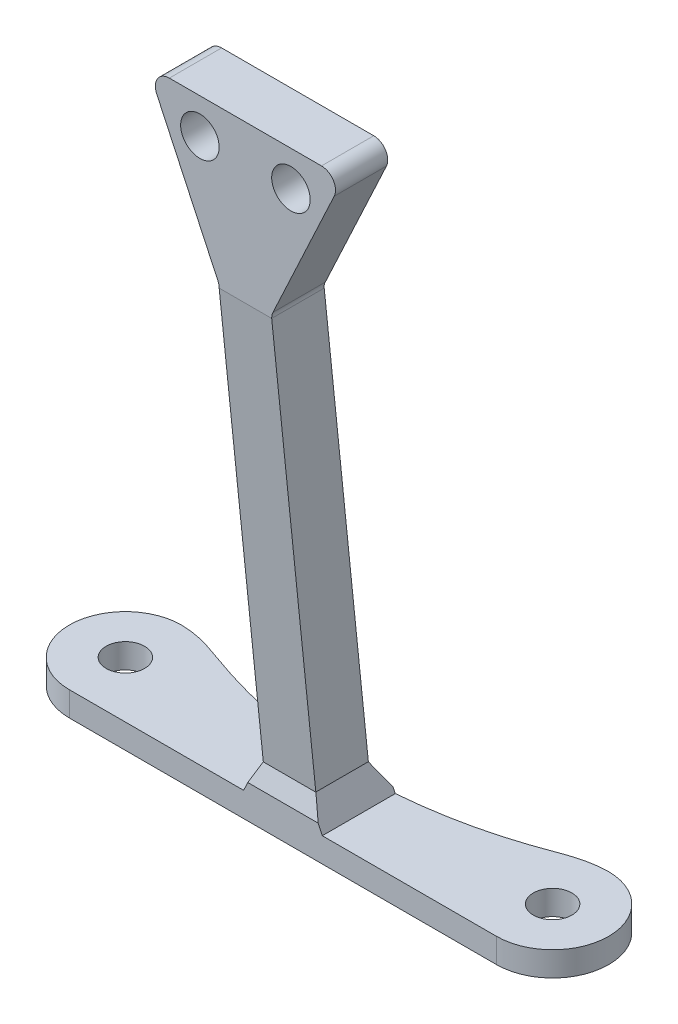
ISO-10303-21;
HEADER;
FILE_DESCRIPTION(('STEP AP214'),'2;1');
FILE_NAME('part.step','',(''),(''),'','','');
FILE_SCHEMA(('AUTOMOTIVE_DESIGN { 1 0 10303 214 1 1 1 1 }'));
ENDSEC;
DATA;
#1=APPLICATION_CONTEXT('core data for automotive mechanical design processes');
#2=APPLICATION_PROTOCOL_DEFINITION('international standard','automotive_design',2000,#1);
#3=PRODUCT_CONTEXT('',#1,'mechanical');
#4=PRODUCT('Part','Part','',(#3));
#5=PRODUCT_RELATED_PRODUCT_CATEGORY('part','',(#4));
#6=PRODUCT_DEFINITION_FORMATION('','',#4);
#7=PRODUCT_DEFINITION_CONTEXT('part definition',#1,'design');
#8=PRODUCT_DEFINITION('design','',#6,#7);
#9=PRODUCT_DEFINITION_SHAPE('','',#8);
#10=(LENGTH_UNIT() NAMED_UNIT(*) SI_UNIT(.MILLI.,.METRE.));
#11=(NAMED_UNIT(*) PLANE_ANGLE_UNIT() SI_UNIT($,.RADIAN.));
#12=(NAMED_UNIT(*) SI_UNIT($,.STERADIAN.) SOLID_ANGLE_UNIT());
#13=UNCERTAINTY_MEASURE_WITH_UNIT(LENGTH_MEASURE(1.E-05),#10,'distance_accuracy_value','');
#14=(GEOMETRIC_REPRESENTATION_CONTEXT(3) GLOBAL_UNCERTAINTY_ASSIGNED_CONTEXT((#13)) GLOBAL_UNIT_ASSIGNED_CONTEXT((#10,
#11,#12)) REPRESENTATION_CONTEXT('',''));
#15=CARTESIAN_POINT('',(0.,0.,0.));
#16=DIRECTION('',(0.,0.,1.));
#17=DIRECTION('',(1.,0.,0.));
#18=AXIS2_PLACEMENT_3D('',#15,#16,#17);
#19=CARTESIAN_POINT('',(0.,45.81,0.));
#20=DIRECTION('',(0.,-1.,0.));
#21=DIRECTION('',(0.,0.,-1.));
#22=AXIS2_PLACEMENT_3D('',#19,#20,#21);
#23=PLANE('',#22);
#24=DIRECTION('',(-1.,0.,0.));
#25=VECTOR('',#24,1.);
#26=CARTESIAN_POINT('',(9.82019635714979,45.81,6.6805667408057));
#27=LINE('',#26,#25);
#28=CARTESIAN_POINT('',(20.6798036428502,45.81,6.6805667408057));
#29=VERTEX_POINT('',#28);
#30=CARTESIAN_POINT('',(9.82019635714979,45.81,6.6805667408057));
#31=VERTEX_POINT('',#30);
#32=EDGE_CURVE('E546',#29,#31,#27,.T.);
#33=ORIENTED_EDGE('',*,*,#32,.F.);
#34=DIRECTION('',(0.,0.,-1.));
#35=VECTOR('',#34,1.);
#36=CARTESIAN_POINT('',(20.6798036428502,45.81,0.));
#37=LINE('',#36,#35);
#38=CARTESIAN_POINT('',(20.6798036428502,45.81,2.95));
#39=VERTEX_POINT('',#38);
#40=EDGE_CURVE('E232',#29,#39,#37,.T.);
#41=ORIENTED_EDGE('',*,*,#40,.T.);
#42=DIRECTION('',(-1.,0.,0.));
#43=VECTOR('',#42,1.);
#44=CARTESIAN_POINT('',(22.25,45.81,2.95));
#45=LINE('',#44,#43);
#46=CARTESIAN_POINT('',(9.82019635714979,45.81,2.95));
#47=VERTEX_POINT('',#46);
#48=EDGE_CURVE('E387',#39,#47,#45,.T.);
#49=ORIENTED_EDGE('',*,*,#48,.T.);
#50=DIRECTION('',(0.,0.,-1.));
#51=VECTOR('',#50,1.);
#52=CARTESIAN_POINT('',(9.82019635714979,45.81,0.));
#53=LINE('',#52,#51);
#54=EDGE_CURVE('E226',#47,#31,#53,.F.);
#55=ORIENTED_EDGE('',*,*,#54,.T.);
#56=EDGE_LOOP('',(#33,#41,#49,#55));
#57=FACE_BOUND('',#56,.T.);
#58=ADVANCED_FACE('F48',(#57),#23,.F.);
#59=CARTESIAN_POINT('',(0.,-0.318008475422429,3.11365631713605));
#60=DIRECTION('',(0.,0.101604896525646,-0.99482483131555));
#61=DIRECTION('',(0.,0.99482483131555,0.101604896525646));
#62=AXIS2_PLACEMENT_3D('',#59,#60,#61);
#63=PLANE('',#62);
#64=DIRECTION('',(1.,0.,0.));
#65=VECTOR('',#64,1.);
#66=CARTESIAN_POINT('',(13.375,34.6060078061076,6.6805667408057));
#67=LINE('',#66,#65);
#68=CARTESIAN_POINT('',(13.375,34.6060078061076,6.6805667408057));
#69=VERTEX_POINT('',#68);
#70=CARTESIAN_POINT('',(17.125,34.6060078061076,6.6805667408057));
#71=VERTEX_POINT('',#70);
#72=EDGE_CURVE('E193',#69,#71,#67,.T.);
#73=ORIENTED_EDGE('',*,*,#72,.F.);
#74=DIRECTION('',(0.,-0.99482483131555,-0.101604896525646));
#75=VECTOR('',#74,1.);
#76=CARTESIAN_POINT('',(13.375,45.81,7.82486916641886));
#77=LINE('',#76,#75);
#78=CARTESIAN_POINT('',(13.375,3.74999999999998,3.52913607517964));
#79=VERTEX_POINT('',#78);
#80=EDGE_CURVE('E207',#69,#79,#77,.T.);
#81=ORIENTED_EDGE('',*,*,#80,.T.);
#82=DIRECTION('',(-0.420819283952313,-0.902449866719604,-0.092170322293196));
#83=VECTOR('',#82,1.);
#84=CARTESIAN_POINT('',(9.44542044298288,-4.67701055471604,2.66845637712649));
#85=LINE('',#84,#83);
#86=CARTESIAN_POINT('',(13.3701735584204,3.73964966263111,3.52807895947016));
#87=VERTEX_POINT('',#86);
#88=EDGE_CURVE('E414',#79,#87,#85,.T.);
#89=ORIENTED_EDGE('',*,*,#88,.T.);
#90=DIRECTION('',(1.,0.,0.));
#91=VECTOR('',#90,1.);
#92=CARTESIAN_POINT('',(0.,3.73964966263111,3.52807895947016));
#93=LINE('',#92,#91);
#94=CARTESIAN_POINT('',(17.1298264415796,3.73964966263111,3.52807895947016));
#95=VERTEX_POINT('',#94);
#96=EDGE_CURVE('E424',#87,#95,#93,.T.);
#97=ORIENTED_EDGE('',*,*,#96,.T.);
#98=DIRECTION('',(-0.420819283952313,0.902449866719604,0.092170322293196));
#99=VECTOR('',#98,1.);
#100=CARTESIAN_POINT('',(15.6533690297599,6.90592280011597,3.85146137251332));
#101=LINE('',#100,#99);
#102=CARTESIAN_POINT('',(17.125,3.74999999999997,3.52913607517964));
#103=VERTEX_POINT('',#102);
#104=EDGE_CURVE('E523',#95,#103,#101,.T.);
#105=ORIENTED_EDGE('',*,*,#104,.T.);
#106=DIRECTION('',(0.,-0.99482483131555,-0.101604896525646));
#107=VECTOR('',#106,1.);
#108=CARTESIAN_POINT('',(17.125,45.81,7.82486916641887));
#109=LINE('',#108,#107);
#110=EDGE_CURVE('E210',#71,#103,#109,.T.);
#111=ORIENTED_EDGE('',*,*,#110,.F.);
#112=EDGE_LOOP('',(#73,#81,#89,#97,#105,#111));
#113=FACE_BOUND('',#112,.T.);
#114=ADVANCED_FACE('F205',(#113),#63,.F.);
#115=CARTESIAN_POINT('',(8.25,45.81,27.6305217725262));
#116=DIRECTION('',(0.906183139995265,0.422885465331124,0.));
#117=DIRECTION('',(-0.422885465331124,0.906183139995265,0.));
#118=AXIS2_PLACEMENT_3D('',#115,#116,#117);
#119=PLANE('',#118);
#120=DIRECTION('',(0.422885465331124,-0.906183139995265,0.));
#121=VECTOR('',#120,1.);
#122=CARTESIAN_POINT('',(13.2811831399953,35.0288932714387,6.6805667408057));
#123=LINE('',#122,#121);
#124=CARTESIAN_POINT('',(8.91401321715453,44.3871145346689,6.6805667408057));
#125=VERTEX_POINT('',#124);
#126=CARTESIAN_POINT('',(13.2811831399953,35.0288932714387,6.6805667408057));
#127=VERTEX_POINT('',#126);
#128=EDGE_CURVE('E196',#125,#127,#123,.T.);
#129=ORIENTED_EDGE('',*,*,#128,.F.);
#130=DIRECTION('',(0.,0.,-1.));
#131=VECTOR('',#130,1.);
#132=CARTESIAN_POINT('',(8.91401321715453,44.3871145346689,27.6305217725262));
#133=LINE('',#132,#131);
#134=CARTESIAN_POINT('',(8.91401321715453,44.3871145346689,2.95));
#135=VERTEX_POINT('',#134);
#136=EDGE_CURVE('E537',#125,#135,#133,.T.);
#137=ORIENTED_EDGE('',*,*,#136,.T.);
#138=DIRECTION('',(0.422885465331124,-0.906183139995265,0.));
#139=VECTOR('',#138,1.);
#140=CARTESIAN_POINT('',(8.25,45.81,2.95));
#141=LINE('',#140,#139);
#142=CARTESIAN_POINT('',(13.3897355304727,34.79628100613,2.95));
#143=VERTEX_POINT('',#142);
#144=EDGE_CURVE('E394',#135,#143,#141,.T.);
#145=ORIENTED_EDGE('',*,*,#144,.T.);
#146=DIRECTION('',(-0.421085842085101,0.902326804468074,0.0921577535203434));
#147=VECTOR('',#146,1.);
#148=CARTESIAN_POINT('',(24.3511281929209,11.3075824437409,0.551018076923493));
#149=LINE('',#148,#147);
#150=CARTESIAN_POINT('',(13.2811831399953,35.0288932714387,2.97375749418723));
#151=VERTEX_POINT('',#150);
#152=EDGE_CURVE('E402',#143,#151,#149,.T.);
#153=ORIENTED_EDGE('',*,*,#152,.T.);
#154=DIRECTION('',(0.,0.,1.));
#155=VECTOR('',#154,1.);
#156=CARTESIAN_POINT('',(13.2811831399953,35.0288932714387,6.70322497991994));
#157=LINE('',#156,#155);
#158=EDGE_CURVE('E535',#151,#127,#157,.T.);
#159=ORIENTED_EDGE('',*,*,#158,.T.);
#160=EDGE_LOOP('',(#129,#137,#145,#153,#159));
#161=FACE_BOUND('',#160,.T.);
#162=ADVANCED_FACE('F347',(#161),#119,.F.);
#163=CARTESIAN_POINT('',(15.25,30.81,27.6305217725262));
#164=DIRECTION('',(-0.906183139995265,0.422885465331124,0.));
#165=DIRECTION('',(-0.422885465331124,-0.906183139995265,0.));
#166=AXIS2_PLACEMENT_3D('',#163,#164,#165);
#167=PLANE('',#166);
#168=DIRECTION('',(0.422885465331124,0.906183139995265,0.));
#169=VECTOR('',#168,1.);
#170=CARTESIAN_POINT('',(21.5859867828455,44.3871145346689,6.6805667408057));
#171=LINE('',#170,#169);
#172=CARTESIAN_POINT('',(17.2188168600047,35.0288932714387,6.6805667408057));
#173=VERTEX_POINT('',#172);
#174=CARTESIAN_POINT('',(21.5859867828455,44.3871145346689,6.6805667408057));
#175=VERTEX_POINT('',#174);
#176=EDGE_CURVE('E65',#173,#175,#171,.T.);
#177=ORIENTED_EDGE('',*,*,#176,.F.);
#178=DIRECTION('',(0.,0.,-1.));
#179=VECTOR('',#178,1.);
#180=CARTESIAN_POINT('',(17.2188168600047,35.0288932714387,2.95322497991993));
#181=LINE('',#180,#179);
#182=CARTESIAN_POINT('',(17.2188168600047,35.0288932714387,2.97375749418723));
#183=VERTEX_POINT('',#182);
#184=EDGE_CURVE('E229',#173,#183,#181,.T.);
#185=ORIENTED_EDGE('',*,*,#184,.T.);
#186=DIRECTION('',(-0.421085842085101,-0.902326804468074,-0.0921577535203434));
#187=VECTOR('',#186,1.);
#188=CARTESIAN_POINT('',(0.740816571741248,-0.281107346268742,-0.632574843072949));
#189=LINE('',#188,#187);
#190=CARTESIAN_POINT('',(17.1102644695273,34.79628100613,2.95));
#191=VERTEX_POINT('',#190);
#192=EDGE_CURVE('E400',#183,#191,#189,.T.);
#193=ORIENTED_EDGE('',*,*,#192,.T.);
#194=DIRECTION('',(0.422885465331124,0.906183139995265,0.));
#195=VECTOR('',#194,1.);
#196=CARTESIAN_POINT('',(15.25,30.81,2.95));
#197=LINE('',#196,#195);
#198=CARTESIAN_POINT('',(21.5859867828455,44.3871145346689,2.95));
#199=VERTEX_POINT('',#198);
#200=EDGE_CURVE('E383',#191,#199,#197,.T.);
#201=ORIENTED_EDGE('',*,*,#200,.T.);
#202=DIRECTION('',(0.,0.,-1.));
#203=VECTOR('',#202,1.);
#204=CARTESIAN_POINT('',(21.5859867828455,44.3871145346689,27.6305217725262));
#205=LINE('',#204,#203);
#206=EDGE_CURVE('E225',#199,#175,#205,.F.);
#207=ORIENTED_EDGE('',*,*,#206,.T.);
#208=EDGE_LOOP('',(#177,#185,#193,#201,#207));
#209=FACE_BOUND('',#208,.T.);
#210=ADVANCED_FACE('F329',(#209),#167,.F.);
#211=CARTESIAN_POINT('',(9.82019635714979,44.81,27.6305217725262));
#212=DIRECTION('',(0.,0.,-1.));
#213=DIRECTION('',(-1.,0.,0.));
#214=AXIS2_PLACEMENT_3D('',#211,#212,#213);
#215=CYLINDRICAL_SURFACE('',#214,1.);
#216=ORIENTED_EDGE('',*,*,#136,.F.);
#217=CARTESIAN_POINT('',(9.82019635714979,44.81,6.6805667408057));
#218=DIRECTION('',(0.,0.,1.));
#219=DIRECTION('',(1.,0.,0.));
#220=AXIS2_PLACEMENT_3D('',#217,#218,#219);
#221=CIRCLE('',#220,0.999999999999999);
#222=EDGE_CURVE('E553',#31,#125,#221,.T.);
#223=ORIENTED_EDGE('',*,*,#222,.F.);
#224=ORIENTED_EDGE('',*,*,#54,.F.);
#225=CARTESIAN_POINT('',(9.82019635714979,44.81,2.95));
#226=DIRECTION('',(0.,0.,1.));
#227=DIRECTION('',(1.,0.,0.));
#228=AXIS2_PLACEMENT_3D('',#225,#226,#227);
#229=CIRCLE('',#228,1.);
#230=EDGE_CURVE('E541',#135,#47,#229,.F.);
#231=ORIENTED_EDGE('',*,*,#230,.F.);
#232=EDGE_LOOP('',(#216,#223,#224,#231));
#233=FACE_BOUND('',#232,.T.);
#234=ADVANCED_FACE('F326',(#233),#215,.T.);
#235=CARTESIAN_POINT('',(12.375,34.6060078061076,27.6305217725262));
#236=DIRECTION('',(0.,0.,-1.));
#237=DIRECTION('',(-1.,0.,0.));
#238=AXIS2_PLACEMENT_3D('',#235,#236,#237);
#239=CYLINDRICAL_SURFACE('',#238,1.);
#240=CARTESIAN_POINT('',(12.375,34.6060078061076,6.6805667408057));
#241=DIRECTION('',(0.,0.,-1.));
#242=DIRECTION('',(1.,0.,0.));
#243=AXIS2_PLACEMENT_3D('',#240,#241,#242);
#244=CIRCLE('',#243,1.);
#245=EDGE_CURVE('E190',#127,#69,#244,.T.);
#246=ORIENTED_EDGE('',*,*,#245,.F.);
#247=ORIENTED_EDGE('',*,*,#158,.F.);
#248=CARTESIAN_POINT('',(12.375,34.6060078061076,2.93056674080571));
#249=DIRECTION('',(0.,-0.101604896525646,0.99482483131555));
#250=DIRECTION('',(0.,-0.99482483131555,-0.101604896525646));
#251=AXIS2_PLACEMENT_3D('',#248,#249,#250);
#252=ELLIPSE('',#251,1.00520209037968,1.);
#253=CARTESIAN_POINT('',(13.375,34.6060078061076,2.93056674080571));
#254=VERTEX_POINT('',#253);
#255=EDGE_CURVE('E57',#254,#151,#252,.T.);
#256=ORIENTED_EDGE('',*,*,#255,.F.);
#257=DIRECTION('',(0.,0.,1.));
#258=VECTOR('',#257,1.);
#259=CARTESIAN_POINT('',(13.375,34.6060078061076,2.95322497991993));
#260=LINE('',#259,#258);
#261=EDGE_CURVE('E215',#69,#254,#260,.F.);
#262=ORIENTED_EDGE('',*,*,#261,.F.);
#263=EDGE_LOOP('',(#246,#247,#256,#262));
#264=FACE_BOUND('',#263,.T.);
#265=ADVANCED_FACE('F223',(#264),#239,.F.);
#266=CARTESIAN_POINT('',(18.125,34.6060078061076,27.6305217725262));
#267=DIRECTION('',(0.,0.,1.));
#268=DIRECTION('',(1.,0.,0.));
#269=AXIS2_PLACEMENT_3D('',#266,#267,#268);
#270=CYLINDRICAL_SURFACE('',#269,1.);
#271=CARTESIAN_POINT('',(18.125,34.6060078061076,6.6805667408057));
#272=DIRECTION('',(0.,0.,-1.));
#273=DIRECTION('',(1.,0.,0.));
#274=AXIS2_PLACEMENT_3D('',#271,#272,#273);
#275=CIRCLE('',#274,1.);
#276=EDGE_CURVE('E211',#71,#173,#275,.T.);
#277=ORIENTED_EDGE('',*,*,#276,.F.);
#278=DIRECTION('',(0.,0.,-1.));
#279=VECTOR('',#278,1.);
#280=CARTESIAN_POINT('',(17.125,34.6060078061076,6.70322497991995));
#281=LINE('',#280,#279);
#282=CARTESIAN_POINT('',(17.125,34.6060078061076,2.93056674080571));
#283=VERTEX_POINT('',#282);
#284=EDGE_CURVE('E240',#283,#71,#281,.F.);
#285=ORIENTED_EDGE('',*,*,#284,.F.);
#286=CARTESIAN_POINT('',(18.125,34.6060078061076,2.93056674080571));
#287=DIRECTION('',(0.,-0.101604896525646,0.99482483131555));
#288=DIRECTION('',(0.,0.99482483131555,0.101604896525646));
#289=AXIS2_PLACEMENT_3D('',#286,#287,#288);
#290=ELLIPSE('',#289,1.00520209037968,1.);
#291=EDGE_CURVE('E12',#183,#283,#290,.T.);
#292=ORIENTED_EDGE('',*,*,#291,.F.);
#293=ORIENTED_EDGE('',*,*,#184,.F.);
#294=EDGE_LOOP('',(#277,#285,#292,#293));
#295=FACE_BOUND('',#294,.T.);
#296=ADVANCED_FACE('F332',(#295),#270,.F.);
#297=CARTESIAN_POINT('',(20.6798036428502,44.81,0.));
#298=DIRECTION('',(0.,0.,-1.));
#299=DIRECTION('',(-1.,0.,0.));
#300=AXIS2_PLACEMENT_3D('',#297,#298,#299);
#301=CYLINDRICAL_SURFACE('',#300,1.);
#302=ORIENTED_EDGE('',*,*,#40,.F.);
#303=CARTESIAN_POINT('',(20.6798036428502,44.81,6.6805667408057));
#304=DIRECTION('',(0.,0.,1.));
#305=DIRECTION('',(1.,0.,0.));
#306=AXIS2_PLACEMENT_3D('',#303,#304,#305);
#307=CIRCLE('',#306,1.);
#308=EDGE_CURVE('E555',#175,#29,#307,.T.);
#309=ORIENTED_EDGE('',*,*,#308,.F.);
#310=ORIENTED_EDGE('',*,*,#206,.F.);
#311=CARTESIAN_POINT('',(20.6798036428502,44.81,2.95));
#312=DIRECTION('',(0.,0.,1.));
#313=DIRECTION('',(1.,0.,0.));
#314=AXIS2_PLACEMENT_3D('',#311,#312,#313);
#315=CIRCLE('',#314,1.);
#316=EDGE_CURVE('E539',#39,#199,#315,.F.);
#317=ORIENTED_EDGE('',*,*,#316,.F.);
#318=EDGE_LOOP('',(#302,#309,#310,#317));
#319=FACE_BOUND('',#318,.T.);
#320=ADVANCED_FACE('F50',(#319),#301,.T.);
#321=CARTESIAN_POINT('',(18.5,43.31,7.82486916641887));
#322=DIRECTION('',(0.,0.,-1.));
#323=DIRECTION('',(-1.,0.,0.));
#324=AXIS2_PLACEMENT_3D('',#321,#322,#323);
#325=CYLINDRICAL_SURFACE('',#324,1.375);
#326=CARTESIAN_POINT('',(18.5,43.31,2.95));
#327=DIRECTION('',(0.,0.,1.));
#328=DIRECTION('',(1.,0.,0.));
#329=AXIS2_PLACEMENT_3D('',#326,#327,#328);
#330=CIRCLE('',#329,1.375);
#331=CARTESIAN_POINT('',(19.875,43.31,2.95));
#332=VERTEX_POINT('',#331);
#333=EDGE_CURVE('E378',#332,#332,#330,.F.);
#334=ORIENTED_EDGE('',*,*,#333,.T.);
#335=EDGE_LOOP('',(#334));
#336=FACE_BOUND('',#335,.T.);
#337=CARTESIAN_POINT('',(18.5,43.31,6.6805667408057));
#338=DIRECTION('',(0.,0.,1.));
#339=DIRECTION('',(1.,0.,0.));
#340=AXIS2_PLACEMENT_3D('',#337,#338,#339);
#341=CIRCLE('',#340,1.375);
#342=CARTESIAN_POINT('',(19.875,43.31,6.6805667408057));
#343=VERTEX_POINT('',#342);
#344=EDGE_CURVE('E381',#343,#343,#341,.T.);
#345=ORIENTED_EDGE('',*,*,#344,.T.);
#346=EDGE_LOOP('',(#345));
#347=FACE_BOUND('',#346,.T.);
#348=ADVANCED_FACE('F338',(#336,#347),#325,.F.);
#349=CARTESIAN_POINT('',(12.,43.31,7.82486916641887));
#350=DIRECTION('',(0.,0.,-1.));
#351=DIRECTION('',(-1.,0.,0.));
#352=AXIS2_PLACEMENT_3D('',#349,#350,#351);
#353=CYLINDRICAL_SURFACE('',#352,1.375);
#354=CARTESIAN_POINT('',(12.,43.31,2.95));
#355=DIRECTION('',(0.,0.,1.));
#356=DIRECTION('',(1.,0.,0.));
#357=AXIS2_PLACEMENT_3D('',#354,#355,#356);
#358=CIRCLE('',#357,1.375);
#359=CARTESIAN_POINT('',(13.375,43.31,2.95));
#360=VERTEX_POINT('',#359);
#361=EDGE_CURVE('E380',#360,#360,#358,.F.);
#362=ORIENTED_EDGE('',*,*,#361,.T.);
#363=EDGE_LOOP('',(#362));
#364=FACE_BOUND('',#363,.T.);
#365=CARTESIAN_POINT('',(12.,43.31,6.6805667408057));
#366=DIRECTION('',(0.,0.,1.));
#367=DIRECTION('',(1.,0.,0.));
#368=AXIS2_PLACEMENT_3D('',#365,#366,#367);
#369=CIRCLE('',#368,1.375);
#370=CARTESIAN_POINT('',(13.375,43.31,6.6805667408057));
#371=VERTEX_POINT('',#370);
#372=EDGE_CURVE('E52',#371,#371,#369,.T.);
#373=ORIENTED_EDGE('',*,*,#372,.T.);
#374=EDGE_LOOP('',(#373));
#375=FACE_BOUND('',#374,.T.);
#376=ADVANCED_FACE('F355',(#364,#375),#353,.F.);
#377=CARTESIAN_POINT('',(0.,0.0610380522536711,-0.5976303516215));
#378=DIRECTION('',(0.,-0.101604896525646,0.99482483131555));
#379=DIRECTION('',(0.,-0.99482483131555,-0.101604896525646));
#380=AXIS2_PLACEMENT_3D('',#377,#378,#379);
#381=PLANE('',#380);
#382=ORIENTED_EDGE('',*,*,#152,.F.);
#383=DIRECTION('',(-1.,0.,0.));
#384=VECTOR('',#383,1.);
#385=CARTESIAN_POINT('',(0.,34.79628100613,2.95));
#386=LINE('',#385,#384);
#387=EDGE_CURVE('E532',#191,#143,#386,.T.);
#388=ORIENTED_EDGE('',*,*,#387,.F.);
#389=ORIENTED_EDGE('',*,*,#192,.F.);
#390=ORIENTED_EDGE('',*,*,#291,.T.);
#391=DIRECTION('',(0.,-0.99482483131555,-0.101604896525646));
#392=VECTOR('',#391,1.);
#393=CARTESIAN_POINT('',(17.125,45.81,4.07486916641886));
#394=LINE('',#393,#392);
#395=CARTESIAN_POINT('',(17.125,3.74999999999997,-0.220863924820357));
#396=VERTEX_POINT('',#395);
#397=EDGE_CURVE('E241',#283,#396,#394,.T.);
#398=ORIENTED_EDGE('',*,*,#397,.T.);
#399=DIRECTION('',(0.420819283952313,-0.902449866719604,-0.092170322293196));
#400=VECTOR('',#399,1.);
#401=CARTESIAN_POINT('',(15.5079175959009,7.21784440662471,0.133319003681943));
#402=LINE('',#401,#400);
#403=CARTESIAN_POINT('',(17.1298264415796,3.73964966263111,-0.221921040529841));
#404=VERTEX_POINT('',#403);
#405=EDGE_CURVE('E293',#396,#404,#402,.T.);
#406=ORIENTED_EDGE('',*,*,#405,.T.);
#407=DIRECTION('',(-1.,0.,0.));
#408=VECTOR('',#407,1.);
#409=CARTESIAN_POINT('',(0.,3.73964966263111,-0.221921040529841));
#410=LINE('',#409,#408);
#411=CARTESIAN_POINT('',(13.3701735584204,3.73964966263111,-0.221921040529841));
#412=VERTEX_POINT('',#411);
#413=EDGE_CURVE('E411',#404,#412,#410,.T.);
#414=ORIENTED_EDGE('',*,*,#413,.T.);
#415=DIRECTION('',(0.420819283952313,0.902449866719604,0.092170322293196));
#416=VECTOR('',#415,1.);
#417=CARTESIAN_POINT('',(9.59087187684191,-4.3650889482073,-1.04968599170489));
#418=LINE('',#417,#416);
#419=CARTESIAN_POINT('',(13.375,3.74999999999998,-0.220863924820357));
#420=VERTEX_POINT('',#419);
#421=EDGE_CURVE('E410',#412,#420,#418,.T.);
#422=ORIENTED_EDGE('',*,*,#421,.T.);
#423=DIRECTION('',(0.,-0.99482483131555,-0.101604896525646));
#424=VECTOR('',#423,1.);
#425=CARTESIAN_POINT('',(13.375,45.81,4.07486916641886));
#426=LINE('',#425,#424);
#427=EDGE_CURVE('E235',#254,#420,#426,.T.);
#428=ORIENTED_EDGE('',*,*,#427,.F.);
#429=ORIENTED_EDGE('',*,*,#255,.T.);
#430=EDGE_LOOP('',(#382,#388,#389,#390,#398,#406,#414,#422,#428,#429));
#431=FACE_BOUND('',#430,.T.);
#432=ADVANCED_FACE('F352',(#431),#381,.F.);
#433=CARTESIAN_POINT('',(13.375,0.,0.));
#434=DIRECTION('',(1.,0.,0.));
#435=DIRECTION('',(0.,1.,0.));
#436=AXIS2_PLACEMENT_3D('',#433,#434,#435);
#437=PLANE('',#436);
#438=ORIENTED_EDGE('',*,*,#80,.F.);
#439=ORIENTED_EDGE('',*,*,#261,.T.);
#440=ORIENTED_EDGE('',*,*,#427,.T.);
#441=DIRECTION('',(0.,0.,1.));
#442=VECTOR('',#441,1.);
#443=CARTESIAN_POINT('',(13.375,3.74999999999998,0.));
#444=LINE('',#443,#442);
#445=EDGE_CURVE('E218',#420,#79,#444,.T.);
#446=ORIENTED_EDGE('',*,*,#445,.T.);
#447=EDGE_LOOP('',(#438,#439,#440,#446));
#448=FACE_BOUND('',#447,.T.);
#449=ADVANCED_FACE('F214',(#448),#437,.F.);
#450=CARTESIAN_POINT('',(17.125,0.,0.));
#451=DIRECTION('',(-1.,0.,0.));
#452=DIRECTION('',(0.,-1.,0.));
#453=AXIS2_PLACEMENT_3D('',#450,#451,#452);
#454=PLANE('',#453);
#455=ORIENTED_EDGE('',*,*,#397,.F.);
#456=ORIENTED_EDGE('',*,*,#284,.T.);
#457=ORIENTED_EDGE('',*,*,#110,.T.);
#458=DIRECTION('',(0.,0.,-1.));
#459=VECTOR('',#458,1.);
#460=CARTESIAN_POINT('',(17.125,3.74999999999997,0.));
#461=LINE('',#460,#459);
#462=EDGE_CURVE('E372',#103,#396,#461,.T.);
#463=ORIENTED_EDGE('',*,*,#462,.T.);
#464=EDGE_LOOP('',(#455,#456,#457,#463));
#465=FACE_BOUND('',#464,.T.);
#466=ADVANCED_FACE('F357',(#465),#454,.F.);
#467=CARTESIAN_POINT('',(0.,1.75,0.));
#468=DIRECTION('',(0.,1.,0.));
#469=DIRECTION('',(0.,0.,1.));
#470=AXIS2_PLACEMENT_3D('',#467,#468,#469);
#471=PLANE('',#470);
#472=CARTESIAN_POINT('',(30.5,1.75,0.));
#473=DIRECTION('',(0.,1.,0.));
#474=DIRECTION('',(0.,0.,1.));
#475=AXIS2_PLACEMENT_3D('',#472,#473,#474);
#476=CIRCLE('',#475,1.375);
#477=CARTESIAN_POINT('',(30.5,1.75,1.375));
#478=VERTEX_POINT('',#477);
#479=EDGE_CURVE('E468',#478,#478,#476,.T.);
#480=ORIENTED_EDGE('',*,*,#479,.F.);
#481=EDGE_LOOP('',(#480));
#482=FACE_BOUND('',#481,.T.);
#483=CARTESIAN_POINT('',(0.,1.75,-4.));
#484=CARTESIAN_POINT('',(1.40507608240739,1.75,-4.));
#485=CARTESIAN_POINT('',(4.62521744231254,1.75,-2.6453543654404));
#486=CARTESIAN_POINT('',(11.3628825555428,1.75,-0.967013817910031));
#487=CARTESIAN_POINT('',(19.1117298328594,1.75,-0.967013817910031));
#488=CARTESIAN_POINT('',(25.9293389659935,1.75,-2.6453543654404));
#489=CARTESIAN_POINT('',(29.0155359570449,1.75,-4.));
#490=CARTESIAN_POINT('',(30.5,1.75,-4.));
#491=B_SPLINE_CURVE_WITH_KNOTS('',3,(#483,#484,#485,#486,#487,#488,#489,#490),.UNSPECIFIED.,.F.,
.F.,(4,1,1,1,1,4),(0.,0.132509581988926,0.331273954972316,0.668726045027684,0.867490418011074,
1.),.UNSPECIFIED.);
#492=CARTESIAN_POINT('',(18.0576153163993,1.75,-1.21446411603511));
#493=VERTEX_POINT('',#492);
#494=CARTESIAN_POINT('',(30.5,1.75,-4.));
#495=VERTEX_POINT('',#494);
#496=EDGE_CURVE('E220',#493,#495,#491,.T.);
#497=ORIENTED_EDGE('',*,*,#496,.F.);
#498=DIRECTION('',(0.,0.,1.));
#499=VECTOR('',#498,1.);
#500=CARTESIAN_POINT('',(18.05761531631,1.75,0.));
#501=LINE('',#500,#499);
#502=CARTESIAN_POINT('',(18.05761531631,1.75,4.));
#503=VERTEX_POINT('',#502);
#504=EDGE_CURVE('E418',#493,#503,#501,.T.);
#505=ORIENTED_EDGE('',*,*,#504,.T.);
#506=DIRECTION('',(1.,0.,0.));
#507=VECTOR('',#506,1.);
#508=CARTESIAN_POINT('',(0.,1.75,4.));
#509=LINE('',#508,#507);
#510=CARTESIAN_POINT('',(30.5,1.75,4.));
#511=VERTEX_POINT('',#510);
#512=EDGE_CURVE('E462',#503,#511,#509,.T.);
#513=ORIENTED_EDGE('',*,*,#512,.T.);
#514=CARTESIAN_POINT('',(30.5,1.75,0.));
#515=DIRECTION('',(0.,1.,0.));
#516=DIRECTION('',(0.,0.,1.));
#517=AXIS2_PLACEMENT_3D('',#514,#515,#516);
#518=CIRCLE('',#517,4.);
#519=EDGE_CURVE('E441',#511,#495,#518,.T.);
#520=ORIENTED_EDGE('',*,*,#519,.T.);
#521=EDGE_LOOP('',(#497,#505,#513,#520));
#522=FACE_BOUND('',#521,.T.);
#523=ADVANCED_FACE('F359',(#482,#522),#471,.T.);
#524=CARTESIAN_POINT('',(0.,1.75,4.));
#525=VERTEX_POINT('',#524);
#526=CARTESIAN_POINT('',(12.44238468369,1.75,4.));
#527=VERTEX_POINT('',#526);
#528=EDGE_CURVE('E459',#525,#527,#509,.T.);
#529=ORIENTED_EDGE('',*,*,#528,.T.);
#530=DIRECTION('',(0.,0.,-1.));
#531=VECTOR('',#530,1.);
#532=CARTESIAN_POINT('',(12.44238468369,1.75,0.));
#533=LINE('',#532,#531);
#534=CARTESIAN_POINT('',(12.442384693446,1.75,-1.21335828672697));
#535=VERTEX_POINT('',#534);
#536=EDGE_CURVE('E422',#527,#535,#533,.T.);
#537=ORIENTED_EDGE('',*,*,#536,.T.);
#538=CARTESIAN_POINT('',(0.,1.75,-4.));
#539=VERTEX_POINT('',#538);
#540=EDGE_CURVE('E254',#539,#535,#491,.T.);
#541=ORIENTED_EDGE('',*,*,#540,.F.);
#542=CARTESIAN_POINT('',(0.,1.75,0.));
#543=DIRECTION('',(0.,1.,0.));
#544=DIRECTION('',(0.,0.,1.));
#545=AXIS2_PLACEMENT_3D('',#542,#543,#544);
#546=CIRCLE('',#545,4.);
#547=EDGE_CURVE('E447',#539,#525,#546,.T.);
#548=ORIENTED_EDGE('',*,*,#547,.T.);
#549=EDGE_LOOP('',(#529,#537,#541,#548));
#550=FACE_BOUND('',#549,.T.);
#551=CARTESIAN_POINT('',(0.,1.75,0.));
#552=DIRECTION('',(0.,1.,0.));
#553=DIRECTION('',(0.,0.,1.));
#554=AXIS2_PLACEMENT_3D('',#551,#552,#553);
#555=CIRCLE('',#554,1.375);
#556=CARTESIAN_POINT('',(0.,1.75,1.375));
#557=VERTEX_POINT('',#556);
#558=EDGE_CURVE('E434',#557,#557,#555,.T.);
#559=ORIENTED_EDGE('',*,*,#558,.F.);
#560=EDGE_LOOP('',(#559));
#561=FACE_BOUND('',#560,.T.);
#562=ADVANCED_FACE('F365',(#550,#561),#471,.T.);
#563=CARTESIAN_POINT('',(0.,0.,0.));
#564=DIRECTION('',(0.,1.,0.));
#565=DIRECTION('',(0.,0.,1.));
#566=AXIS2_PLACEMENT_3D('',#563,#564,#565);
#567=PLANE('',#566);
#568=CARTESIAN_POINT('',(0.,0.,0.));
#569=DIRECTION('',(0.,1.,0.));
#570=DIRECTION('',(0.,0.,1.));
#571=AXIS2_PLACEMENT_3D('',#568,#569,#570);
#572=CIRCLE('',#571,4.);
#573=CARTESIAN_POINT('',(0.,0.,-4.));
#574=VERTEX_POINT('',#573);
#575=CARTESIAN_POINT('',(0.,0.,4.));
#576=VERTEX_POINT('',#575);
#577=EDGE_CURVE('E430',#574,#576,#572,.T.);
#578=ORIENTED_EDGE('',*,*,#577,.F.);
#579=CARTESIAN_POINT('',(0.,0.,-4.));
#580=CARTESIAN_POINT('',(1.40507608240739,0.,-4.));
#581=CARTESIAN_POINT('',(4.62521744231254,0.,-2.6453543654404));
#582=CARTESIAN_POINT('',(11.3628825555428,0.,-0.967013817910031));
#583=CARTESIAN_POINT('',(19.1117298328594,0.,-0.967013817910031));
#584=CARTESIAN_POINT('',(25.9293389659935,0.,-2.6453543654404));
#585=CARTESIAN_POINT('',(29.0155359570449,0.,-4.));
#586=CARTESIAN_POINT('',(30.5,0.,-4.));
#587=B_SPLINE_CURVE_WITH_KNOTS('',3,(#579,#580,#581,#582,#583,#584,#585,#586),.UNSPECIFIED.,.F.,
.F.,(4,1,1,1,1,4),(0.,0.132509581988926,0.331273954972316,0.668726045027684,0.867490418011074,
1.),.UNSPECIFIED.);
#588=CARTESIAN_POINT('',(30.5,0.,-4.));
#589=VERTEX_POINT('',#588);
#590=EDGE_CURVE('E474',#574,#589,#587,.T.);
#591=ORIENTED_EDGE('',*,*,#590,.T.);
#592=CARTESIAN_POINT('',(30.5,0.,0.));
#593=DIRECTION('',(0.,1.,0.));
#594=DIRECTION('',(0.,0.,1.));
#595=AXIS2_PLACEMENT_3D('',#592,#593,#594);
#596=CIRCLE('',#595,4.);
#597=CARTESIAN_POINT('',(30.5,0.,4.));
#598=VERTEX_POINT('',#597);
#599=EDGE_CURVE('E444',#598,#589,#596,.T.);
#600=ORIENTED_EDGE('',*,*,#599,.F.);
#601=DIRECTION('',(1.,0.,0.));
#602=VECTOR('',#601,1.);
#603=CARTESIAN_POINT('',(0.,0.,4.));
#604=LINE('',#603,#602);
#605=EDGE_CURVE('E433',#576,#598,#604,.T.);
#606=ORIENTED_EDGE('',*,*,#605,.F.);
#607=EDGE_LOOP('',(#578,#591,#600,#606));
#608=FACE_BOUND('',#607,.T.);
#609=CARTESIAN_POINT('',(0.,0.,0.));
#610=DIRECTION('',(0.,1.,0.));
#611=DIRECTION('',(0.,0.,1.));
#612=AXIS2_PLACEMENT_3D('',#609,#610,#611);
#613=CIRCLE('',#612,1.375);
#614=CARTESIAN_POINT('',(0.,0.,1.375));
#615=VERTEX_POINT('',#614);
#616=EDGE_CURVE('E465',#615,#615,#613,.T.);
#617=ORIENTED_EDGE('',*,*,#616,.T.);
#618=EDGE_LOOP('',(#617));
#619=FACE_BOUND('',#618,.T.);
#620=CARTESIAN_POINT('',(30.5,0.,0.));
#621=DIRECTION('',(0.,1.,0.));
#622=DIRECTION('',(0.,0.,1.));
#623=AXIS2_PLACEMENT_3D('',#620,#621,#622);
#624=CIRCLE('',#623,1.375);
#625=CARTESIAN_POINT('',(30.5,0.,1.375));
#626=VERTEX_POINT('',#625);
#627=EDGE_CURVE('E471',#626,#626,#624,.T.);
#628=ORIENTED_EDGE('',*,*,#627,.T.);
#629=EDGE_LOOP('',(#628));
#630=FACE_BOUND('',#629,.T.);
#631=ADVANCED_FACE('F500',(#608,#619,#630),#567,.F.);
#632=CARTESIAN_POINT('',(0.,1.75,0.));
#633=DIRECTION('',(0.,-1.,0.));
#634=DIRECTION('',(0.,0.,-1.));
#635=AXIS2_PLACEMENT_3D('',#632,#633,#634);
#636=CYLINDRICAL_SURFACE('',#635,4.);
#637=ORIENTED_EDGE('',*,*,#577,.T.);
#638=DIRECTION('',(0.,-1.,0.));
#639=VECTOR('',#638,1.);
#640=CARTESIAN_POINT('',(0.,1.75,4.));
#641=LINE('',#640,#639);
#642=EDGE_CURVE('E427',#525,#576,#641,.T.);
#643=ORIENTED_EDGE('',*,*,#642,.F.);
#644=ORIENTED_EDGE('',*,*,#547,.F.);
#645=DIRECTION('',(0.,-1.,0.));
#646=VECTOR('',#645,1.);
#647=CARTESIAN_POINT('',(0.,1.75,-4.));
#648=LINE('',#647,#646);
#649=EDGE_CURVE('E437',#539,#574,#648,.T.);
#650=ORIENTED_EDGE('',*,*,#649,.T.);
#651=EDGE_LOOP('',(#637,#643,#644,#650));
#652=FACE_BOUND('',#651,.T.);
#653=ADVANCED_FACE('F507',(#652),#636,.T.);
#654=CARTESIAN_POINT('',(0.,1.75,4.));
#655=DIRECTION('',(0.,0.,-1.));
#656=DIRECTION('',(-1.,0.,0.));
#657=AXIS2_PLACEMENT_3D('',#654,#655,#656);
#658=PLANE('',#657);
#659=ORIENTED_EDGE('',*,*,#605,.T.);
#660=DIRECTION('',(0.,-1.,0.));
#661=VECTOR('',#660,1.);
#662=CARTESIAN_POINT('',(30.5,1.75,4.));
#663=LINE('',#662,#661);
#664=EDGE_CURVE('E451',#511,#598,#663,.T.);
#665=ORIENTED_EDGE('',*,*,#664,.F.);
#666=ORIENTED_EDGE('',*,*,#512,.F.);
#667=DIRECTION('',(-0.422618261740702,0.906307787036649,0.));
#668=VECTOR('',#667,1.);
#669=CARTESIAN_POINT('',(14.8324133510599,8.66646793451975,4.));
#670=LINE('',#669,#668);
#671=CARTESIAN_POINT('',(17.762877612803,2.38206704490579,4.));
#672=VERTEX_POINT('',#671);
#673=EDGE_CURVE('E520',#503,#672,#670,.T.);
#674=ORIENTED_EDGE('',*,*,#673,.T.);
#675=DIRECTION('',(-1.,0.,0.));
#676=VECTOR('',#675,1.);
#677=CARTESIAN_POINT('',(0.,2.38206704490579,4.));
#678=LINE('',#677,#676);
#679=CARTESIAN_POINT('',(12.737122387197,2.38206704490579,4.));
#680=VERTEX_POINT('',#679);
#681=EDGE_CURVE('E417',#672,#680,#678,.T.);
#682=ORIENTED_EDGE('',*,*,#681,.T.);
#683=DIRECTION('',(-0.422618261740703,-0.906307787036648,0.));
#684=VECTOR('',#683,1.);
#685=CARTESIAN_POINT('',(10.2200976966597,-3.01570982304473,4.));
#686=LINE('',#685,#684);
#687=EDGE_CURVE('E512',#680,#527,#686,.T.);
#688=ORIENTED_EDGE('',*,*,#687,.T.);
#689=ORIENTED_EDGE('',*,*,#528,.F.);
#690=ORIENTED_EDGE('',*,*,#642,.T.);
#691=EDGE_LOOP('',(#659,#665,#666,#674,#682,#688,#689,#690));
#692=FACE_BOUND('',#691,.T.);
#693=ADVANCED_FACE('F504',(#692),#658,.F.);
#694=CARTESIAN_POINT('',(30.5,1.75,0.));
#695=DIRECTION('',(0.,-1.,0.));
#696=DIRECTION('',(0.,0.,-1.));
#697=AXIS2_PLACEMENT_3D('',#694,#695,#696);
#698=CYLINDRICAL_SURFACE('',#697,4.);
#699=ORIENTED_EDGE('',*,*,#599,.T.);
#700=DIRECTION('',(0.,-1.,0.));
#701=VECTOR('',#700,1.);
#702=CARTESIAN_POINT('',(30.5,1.75,-4.));
#703=LINE('',#702,#701);
#704=EDGE_CURVE('E440',#495,#589,#703,.T.);
#705=ORIENTED_EDGE('',*,*,#704,.F.);
#706=ORIENTED_EDGE('',*,*,#519,.F.);
#707=ORIENTED_EDGE('',*,*,#664,.T.);
#708=EDGE_LOOP('',(#699,#705,#706,#707));
#709=FACE_BOUND('',#708,.T.);
#710=ADVANCED_FACE('F499',(#709),#698,.T.);
#711=CARTESIAN_POINT('',(0.,1.75,0.));
#712=DIRECTION('',(0.,-1.,0.));
#713=DIRECTION('',(0.,0.,-1.));
#714=AXIS2_PLACEMENT_3D('',#711,#712,#713);
#715=CYLINDRICAL_SURFACE('',#714,1.375);
#716=ORIENTED_EDGE('',*,*,#558,.T.);
#717=EDGE_LOOP('',(#716));
#718=FACE_BOUND('',#717,.T.);
#719=ORIENTED_EDGE('',*,*,#616,.F.);
#720=EDGE_LOOP('',(#719));
#721=FACE_BOUND('',#720,.T.);
#722=ADVANCED_FACE('F710',(#718,#721),#715,.F.);
#723=CARTESIAN_POINT('',(30.5,1.75,0.));
#724=DIRECTION('',(0.,-1.,0.));
#725=DIRECTION('',(0.,0.,-1.));
#726=AXIS2_PLACEMENT_3D('',#723,#724,#725);
#727=CYLINDRICAL_SURFACE('',#726,1.375);
#728=ORIENTED_EDGE('',*,*,#479,.T.);
#729=EDGE_LOOP('',(#728));
#730=FACE_BOUND('',#729,.T.);
#731=ORIENTED_EDGE('',*,*,#627,.F.);
#732=EDGE_LOOP('',(#731));
#733=FACE_BOUND('',#732,.T.);
#734=ADVANCED_FACE('F268',(#730,#733),#727,.F.);
#735=CARTESIAN_POINT('',(0.,-8.25,-4.));
#736=CARTESIAN_POINT('',(1.40507608240739,-8.25,-4.));
#737=CARTESIAN_POINT('',(4.62521744231254,-8.25,-2.6453543654404));
#738=CARTESIAN_POINT('',(11.3628825555428,-8.25,-0.967013817910031));
#739=CARTESIAN_POINT('',(19.1117298328594,-8.25,-0.967013817910031));
#740=CARTESIAN_POINT('',(25.9293389659935,-8.25,-2.6453543654404));
#741=CARTESIAN_POINT('',(29.0155359570449,-8.25,-4.));
#742=CARTESIAN_POINT('',(30.5,-8.25,-4.));
#743=B_SPLINE_CURVE_WITH_KNOTS('',3,(#735,#736,#737,#738,#739,#740,#741,#742),.UNSPECIFIED.,.F.,
.F.,(4,1,1,1,1,4),(0.,0.132509581988926,0.331273954972316,0.668726045027684,0.867490418011074,
1.),.UNSPECIFIED.);
#744=DIRECTION('',(0.,1.,0.));
#745=VECTOR('',#744,1.);
#746=SURFACE_OF_LINEAR_EXTRUSION('',#743,#745);
#747=ORIENTED_EDGE('',*,*,#540,.T.);
#748=CARTESIAN_POINT('',(12.44238468369,1.75,-1.21335828672697));
#749=CARTESIAN_POINT('',(12.4695937188454,1.80834996419108,-1.21115148486882));
#750=CARTESIAN_POINT('',(12.496803211164,1.86670090877192,-1.20897720152905));
#751=CARTESIAN_POINT('',(12.5512231101277,1.98340475871311,-1.20469367188628));
#752=CARTESIAN_POINT('',(12.5784335167729,2.04175766407347,-1.20258442558328));
#753=CARTESIAN_POINT('',(12.6056443805813,2.10011154982359,-1.20050769779866));
#754=B_SPLINE_CURVE_WITH_KNOTS('',3,(#748,#749,#750,#751,#752,#753),.UNSPECIFIED.,.F.,.F.,(4,2,
4),(0.,0.193259541611261,0.386519083222521),.UNSPECIFIED.);
#755=CARTESIAN_POINT('',(12.6056443805813,2.10011154982359,-1.20050769779866));
#756=VERTEX_POINT('',#755);
#757=EDGE_CURVE('E292',#535,#756,#754,.T.);
#758=ORIENTED_EDGE('',*,*,#757,.T.);
#759=CARTESIAN_POINT('',(12.6056443805813,2.10011154982359,-1.20050769779866));
#760=CARTESIAN_POINT('',(12.8242217275633,2.12806318247983,-1.18382428278525));
#761=CARTESIAN_POINT('',(13.0433799466291,2.15256725058593,-1.1691986062547));
#762=CARTESIAN_POINT('',(13.4826023790778,2.19461293442408,-1.14410291321875));
#763=CARTESIAN_POINT('',(13.7026666020623,2.21215447617686,-1.13363294086916));
#764=CARTESIAN_POINT('',(14.361344443096,2.25407550071569,-1.10861165289038));
#765=CARTESIAN_POINT('',(14.8009119368352,2.26806740794337,-1.10026034125219));
#766=CARTESIAN_POINT('',(15.6833763216088,2.26806733333943,-1.10026038578084));
#767=CARTESIAN_POINT('',(16.1262732159132,2.25386261932149,-1.10873871482954));
#768=CARTESIAN_POINT('',(16.7899335255015,2.2114201125942,-1.1340712584648));
#769=CARTESIAN_POINT('',(17.0116664856267,2.19366948824722,-1.14466602537412));
#770=CARTESIAN_POINT('',(17.4542143760021,2.1511574828653,-1.17004005048248));
#771=CARTESIAN_POINT('',(17.6750293269922,2.12639626109846,-1.1848192136196));
#772=CARTESIAN_POINT('',(17.895259442623,2.09817329470702,-1.20166457886208));
#773=B_SPLINE_CURVE_WITH_KNOTS('',3,(#759,#760,#761,#762,#763,#764,#765,#766,#767,#768,#769,
#770,#771,#772),.UNSPECIFIED.,.F.,.F.,(4,2,2,2,2,2,4),(0.,0.662891969571223,1.32579098241258,
2.6441197927044,3.97243266962407,4.64038362901273,5.30831941498076),.UNSPECIFIED.);
#774=CARTESIAN_POINT('',(17.895259442623,2.09817329470702,-1.20166457886208));
#775=VERTEX_POINT('',#774);
#776=EDGE_CURVE('E275',#756,#775,#773,.T.);
#777=ORIENTED_EDGE('',*,*,#776,.T.);
#778=CARTESIAN_POINT('',(17.895259442623,2.09817329470703,-1.20166457886208));
#779=CARTESIAN_POINT('',(17.9223196505449,2.04014249154814,-1.20373422715869));
#780=CARTESIAN_POINT('',(17.9493794106464,1.98211264874309,-1.20583567940415));
#781=CARTESIAN_POINT('',(18.0034980352088,1.86605488384068,-1.21010219179275));
#782=CARTESIAN_POINT('',(18.0305568996696,1.80802696174331,-1.21226725193589));
#783=CARTESIAN_POINT('',(18.0576153163101,1.74999999999979,-1.21446411602787));
#784=B_SPLINE_CURVE_WITH_KNOTS('',3,(#778,#779,#780,#781,#782,#783),.UNSPECIFIED.,.F.,.F.,(4,2,
4),(0.,0.192189969479249,0.384379938958498),.UNSPECIFIED.);
#785=EDGE_CURVE('E285',#775,#493,#784,.T.);
#786=ORIENTED_EDGE('',*,*,#785,.T.);
#787=ORIENTED_EDGE('',*,*,#496,.T.);
#788=ORIENTED_EDGE('',*,*,#704,.T.);
#789=ORIENTED_EDGE('',*,*,#590,.F.);
#790=ORIENTED_EDGE('',*,*,#649,.F.);
#791=EDGE_LOOP('',(#747,#758,#777,#786,#787,#788,#789,#790));
#792=FACE_BOUND('',#791,.T.);
#793=ADVANCED_FACE('F262',(#792),#746,.F.);
#794=CARTESIAN_POINT('',(0.,1.75,4.2197182945789));
#795=DIRECTION('',(0.,-0.328345832024823,-0.944557576112715));
#796=DIRECTION('',(-1.,0.,0.));
#797=AXIS2_PLACEMENT_3D('',#794,#795,#796);
#798=PLANE('',#797);
#799=ORIENTED_EDGE('',*,*,#96,.F.);
#800=DIRECTION('',(-0.403087008438187,-0.864422879163179,0.300489516635095));
#801=VECTOR('',#800,1.);
#802=CARTESIAN_POINT('',(10.4207567658802,-2.58539506043832,5.72678248449764));
#803=LINE('',#802,#801);
#804=EDGE_CURVE('E244',#680,#87,#803,.F.);
#805=ORIENTED_EDGE('',*,*,#804,.F.);
#806=ORIENTED_EDGE('',*,*,#681,.F.);
#807=DIRECTION('',(-0.403087008438187,0.864422879163179,-0.300489516635095));
#808=VECTOR('',#807,1.);
#809=CARTESIAN_POINT('',(15.1236295747845,8.04195272737769,2.03251816450959));
#810=LINE('',#809,#808);
#811=EDGE_CURVE('E526',#95,#672,#810,.F.);
#812=ORIENTED_EDGE('',*,*,#811,.F.);
#813=EDGE_LOOP('',(#799,#805,#806,#812));
#814=FACE_BOUND('',#813,.T.);
#815=ADVANCED_FACE('F267',(#814),#798,.F.);
#816=CARTESIAN_POINT('',(12.44238468369,1.75,0.));
#817=DIRECTION('',(0.906307787036649,-0.422618261740703,0.));
#818=DIRECTION('',(0.,0.,-1.));
#819=AXIS2_PLACEMENT_3D('',#816,#817,#818);
#820=PLANE('',#819);
#821=ORIENTED_EDGE('',*,*,#445,.F.);
#822=ORIENTED_EDGE('',*,*,#421,.F.);
#823=DIRECTION('',(0.371717055550123,0.797149798098667,0.475792633407036));
#824=VECTOR('',#823,1.);
#825=CARTESIAN_POINT('',(10.7231759802602,-1.93685496230534,-3.61004092776769));
#826=LINE('',#825,#824);
#827=EDGE_CURVE('E513',#756,#412,#826,.T.);
#828=ORIENTED_EDGE('',*,*,#827,.F.);
#829=ORIENTED_EDGE('',*,*,#757,.F.);
#830=ORIENTED_EDGE('',*,*,#536,.F.);
#831=ORIENTED_EDGE('',*,*,#687,.F.);
#832=ORIENTED_EDGE('',*,*,#804,.T.);
#833=ORIENTED_EDGE('',*,*,#88,.F.);
#834=EDGE_LOOP('',(#821,#822,#828,#829,#830,#831,#832,#833));
#835=FACE_BOUND('',#834,.T.);
#836=ADVANCED_FACE('F310',(#835),#820,.F.);
#837=CARTESIAN_POINT('',(18.05761531631,1.75,0.));
#838=DIRECTION('',(-0.906307787036648,-0.422618261740702,0.));
#839=DIRECTION('',(0.,0.,1.));
#840=AXIS2_PLACEMENT_3D('',#837,#838,#839);
#841=PLANE('',#840);
#842=ORIENTED_EDGE('',*,*,#504,.F.);
#843=ORIENTED_EDGE('',*,*,#785,.F.);
#844=DIRECTION('',(0.371717055550122,-0.797149798098667,-0.475792633407036));
#845=VECTOR('',#844,1.);
#846=CARTESIAN_POINT('',(15.5625301534407,7.10072739903379,1.78419629287862));
#847=LINE('',#846,#845);
#848=EDGE_CURVE('E404',#404,#775,#847,.T.);
#849=ORIENTED_EDGE('',*,*,#848,.F.);
#850=ORIENTED_EDGE('',*,*,#405,.F.);
#851=ORIENTED_EDGE('',*,*,#462,.F.);
#852=ORIENTED_EDGE('',*,*,#104,.F.);
#853=ORIENTED_EDGE('',*,*,#811,.T.);
#854=ORIENTED_EDGE('',*,*,#673,.F.);
#855=EDGE_LOOP('',(#842,#843,#849,#850,#851,#852,#853,#854));
#856=FACE_BOUND('',#855,.T.);
#857=ADVANCED_FACE('F302',(#856),#841,.F.);
#858=CARTESIAN_POINT('',(0.,1.75,-1.409477826969));
#859=DIRECTION('',(0.,-0.512516449869314,0.858677406604689));
#860=DIRECTION('',(1.,0.,0.));
#861=AXIS2_PLACEMENT_3D('',#858,#859,#860);
#862=PLANE('',#861);
#863=ORIENTED_EDGE('',*,*,#827,.T.);
#864=ORIENTED_EDGE('',*,*,#413,.F.);
#865=ORIENTED_EDGE('',*,*,#848,.T.);
#866=ORIENTED_EDGE('',*,*,#776,.F.);
#867=EDGE_LOOP('',(#863,#864,#865,#866));
#868=FACE_BOUND('',#867,.T.);
#869=ADVANCED_FACE('F309',(#868),#862,.F.);
#870=CARTESIAN_POINT('',(0.,0.,2.95));
#871=DIRECTION('',(0.,0.,1.));
#872=DIRECTION('',(1.,0.,0.));
#873=AXIS2_PLACEMENT_3D('',#870,#871,#872);
#874=PLANE('',#873);
#875=ORIENTED_EDGE('',*,*,#361,.F.);
#876=EDGE_LOOP('',(#875));
#877=FACE_BOUND('',#876,.T.);
#878=ORIENTED_EDGE('',*,*,#333,.F.);
#879=EDGE_LOOP('',(#878));
#880=FACE_BOUND('',#879,.T.);
#881=ORIENTED_EDGE('',*,*,#144,.F.);
#882=ORIENTED_EDGE('',*,*,#230,.T.);
#883=ORIENTED_EDGE('',*,*,#48,.F.);
#884=ORIENTED_EDGE('',*,*,#316,.T.);
#885=ORIENTED_EDGE('',*,*,#200,.F.);
#886=ORIENTED_EDGE('',*,*,#387,.T.);
#887=EDGE_LOOP('',(#881,#882,#883,#884,#885,#886));
#888=FACE_BOUND('',#887,.T.);
#889=ADVANCED_FACE('F549',(#877,#880,#888),#874,.F.);
#890=CARTESIAN_POINT('',(12.375,34.6060078061076,6.6805667408057));
#891=DIRECTION('',(0.,0.,1.));
#892=DIRECTION('',(1.,0.,0.));
#893=AXIS2_PLACEMENT_3D('',#890,#891,#892);
#894=PLANE('',#893);
#895=ORIENTED_EDGE('',*,*,#344,.F.);
#896=EDGE_LOOP('',(#895));
#897=FACE_BOUND('',#896,.T.);
#898=ORIENTED_EDGE('',*,*,#372,.F.);
#899=EDGE_LOOP('',(#898));
#900=FACE_BOUND('',#899,.T.);
#901=ORIENTED_EDGE('',*,*,#245,.T.);
#902=ORIENTED_EDGE('',*,*,#72,.T.);
#903=ORIENTED_EDGE('',*,*,#276,.T.);
#904=ORIENTED_EDGE('',*,*,#176,.T.);
#905=ORIENTED_EDGE('',*,*,#308,.T.);
#906=ORIENTED_EDGE('',*,*,#32,.T.);
#907=ORIENTED_EDGE('',*,*,#222,.T.);
#908=ORIENTED_EDGE('',*,*,#128,.T.);
#909=EDGE_LOOP('',(#901,#902,#903,#904,#905,#906,#907,#908));
#910=FACE_BOUND('',#909,.T.);
#911=ADVANCED_FACE('F192',(#897,#900,#910),#894,.T.);
#912=CLOSED_SHELL('',(#58,#114,#162,#210,#234,#265,#296,#320,#348,#376,#432,#449,#466,#523,#562,
#631,#653,#693,#710,#722,#734,#793,#815,#836,#857,#869,#889,#911));
#913=MANIFOLD_SOLID_BREP('B2',#912);
#914=ADVANCED_BREP_SHAPE_REPRESENTATION('',(#18,#913),#14);
#915=SHAPE_DEFINITION_REPRESENTATION(#9,#914);
ENDSEC;
END-ISO-10303-21;
